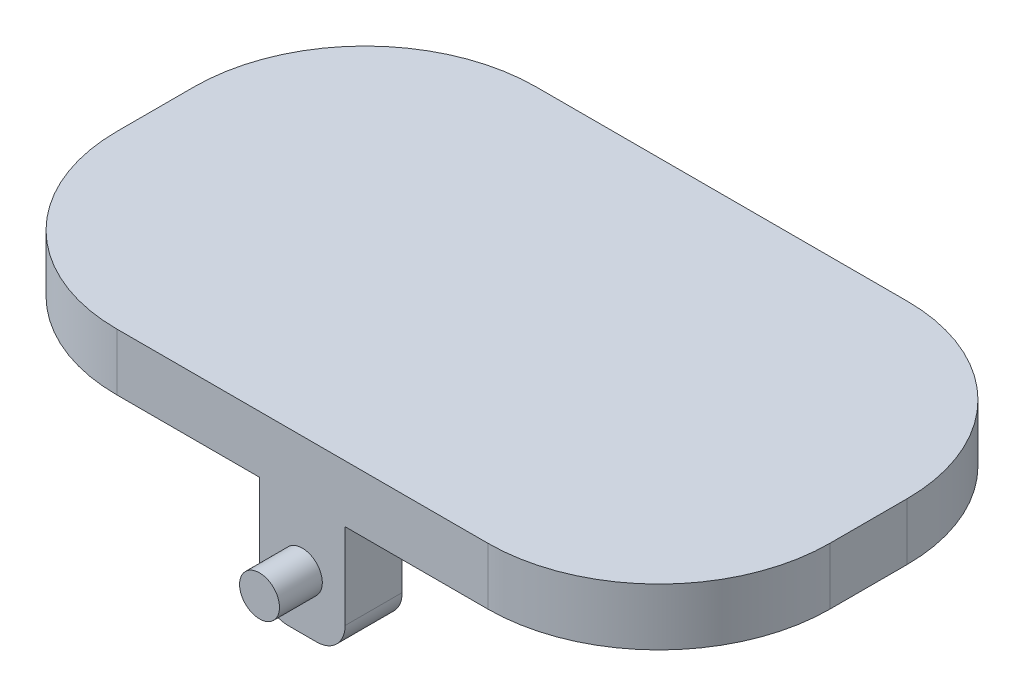
ISO-10303-21;
HEADER;
FILE_DESCRIPTION(('STEP AP214'),'2;1');
FILE_NAME('part.step','',(''),(''),'','','');
FILE_SCHEMA(('AUTOMOTIVE_DESIGN { 1 0 10303 214 1 1 1 1 }'));
ENDSEC;
DATA;
#1=APPLICATION_CONTEXT('core data for automotive mechanical design processes');
#2=APPLICATION_PROTOCOL_DEFINITION('international standard','automotive_design',2000,#1);
#3=PRODUCT_CONTEXT('',#1,'mechanical');
#4=PRODUCT('Part','Part','',(#3));
#5=PRODUCT_RELATED_PRODUCT_CATEGORY('part','',(#4));
#6=PRODUCT_DEFINITION_FORMATION('','',#4);
#7=PRODUCT_DEFINITION_CONTEXT('part definition',#1,'design');
#8=PRODUCT_DEFINITION('design','',#6,#7);
#9=PRODUCT_DEFINITION_SHAPE('','',#8);
#10=(LENGTH_UNIT() NAMED_UNIT(*) SI_UNIT(.MILLI.,.METRE.));
#11=(NAMED_UNIT(*) PLANE_ANGLE_UNIT() SI_UNIT($,.RADIAN.));
#12=(NAMED_UNIT(*) SI_UNIT($,.STERADIAN.) SOLID_ANGLE_UNIT());
#13=UNCERTAINTY_MEASURE_WITH_UNIT(LENGTH_MEASURE(1.E-05),#10,'distance_accuracy_value','');
#14=(GEOMETRIC_REPRESENTATION_CONTEXT(3) GLOBAL_UNCERTAINTY_ASSIGNED_CONTEXT((#13)) GLOBAL_UNIT_ASSIGNED_CONTEXT((#10,
#11,#12)) REPRESENTATION_CONTEXT('',''));
#15=CARTESIAN_POINT('',(0.,0.,0.));
#16=DIRECTION('',(0.,0.,1.));
#17=DIRECTION('',(1.,0.,0.));
#18=AXIS2_PLACEMENT_3D('',#15,#16,#17);
#19=CARTESIAN_POINT('',(0.,0.,0.));
#20=DIRECTION('',(0.,1.,0.));
#21=DIRECTION('',(0.,0.,1.));
#22=AXIS2_PLACEMENT_3D('',#19,#20,#21);
#23=PLANE('',#22);
#24=DIRECTION('',(0.,0.,1.));
#25=VECTOR('',#24,1.);
#26=CARTESIAN_POINT('',(1.5,0.,5.35));
#27=LINE('',#26,#25);
#28=CARTESIAN_POINT('',(1.5,0.,5.35));
#29=VERTEX_POINT('',#28);
#30=CARTESIAN_POINT('',(1.5,0.,7.35));
#31=VERTEX_POINT('',#30);
#32=EDGE_CURVE('E50',#29,#31,#27,.T.);
#33=ORIENTED_EDGE('',*,*,#32,.F.);
#34=DIRECTION('',(1.,0.,0.));
#35=VECTOR('',#34,1.);
#36=CARTESIAN_POINT('',(-1.5,0.,5.35));
#37=LINE('',#36,#35);
#38=CARTESIAN_POINT('',(-1.5,0.,5.35));
#39=VERTEX_POINT('',#38);
#40=EDGE_CURVE('E176',#39,#29,#37,.T.);
#41=ORIENTED_EDGE('',*,*,#40,.F.);
#42=DIRECTION('',(0.,0.,1.));
#43=VECTOR('',#42,1.);
#44=CARTESIAN_POINT('',(-1.5,0.,5.35));
#45=LINE('',#44,#43);
#46=CARTESIAN_POINT('',(-1.5,0.,7.35));
#47=VERTEX_POINT('',#46);
#48=EDGE_CURVE('E184',#39,#47,#45,.T.);
#49=ORIENTED_EDGE('',*,*,#48,.T.);
#50=DIRECTION('',(1.,0.,0.));
#51=VECTOR('',#50,1.);
#52=CARTESIAN_POINT('',(-12.5,0.,7.35));
#53=LINE('',#52,#51);
#54=CARTESIAN_POINT('',(-6.5,0.,7.35));
#55=VERTEX_POINT('',#54);
#56=EDGE_CURVE('E278',#55,#47,#53,.T.);
#57=ORIENTED_EDGE('',*,*,#56,.F.);
#58=CARTESIAN_POINT('',(-6.5,0.,1.35));
#59=DIRECTION('',(0.,1.,0.));
#60=DIRECTION('',(0.,0.,1.));
#61=AXIS2_PLACEMENT_3D('',#58,#59,#60);
#62=CIRCLE('',#61,6.);
#63=CARTESIAN_POINT('',(-12.5,0.,1.35));
#64=VERTEX_POINT('',#63);
#65=EDGE_CURVE('E311',#55,#64,#62,.F.);
#66=ORIENTED_EDGE('',*,*,#65,.T.);
#67=DIRECTION('',(0.,0.,1.));
#68=VECTOR('',#67,1.);
#69=CARTESIAN_POINT('',(-12.5,0.,-7.35));
#70=LINE('',#69,#68);
#71=CARTESIAN_POINT('',(-12.5,0.,-1.35));
#72=VERTEX_POINT('',#71);
#73=EDGE_CURVE('E294',#72,#64,#70,.T.);
#74=ORIENTED_EDGE('',*,*,#73,.F.);
#75=CARTESIAN_POINT('',(-6.5,0.,-1.35));
#76=DIRECTION('',(0.,1.,0.));
#77=DIRECTION('',(0.,0.,1.));
#78=AXIS2_PLACEMENT_3D('',#75,#76,#77);
#79=CIRCLE('',#78,6.);
#80=CARTESIAN_POINT('',(-6.5,0.,-7.35));
#81=VERTEX_POINT('',#80);
#82=EDGE_CURVE('E308',#72,#81,#79,.F.);
#83=ORIENTED_EDGE('',*,*,#82,.T.);
#84=DIRECTION('',(-1.,0.,0.));
#85=VECTOR('',#84,1.);
#86=CARTESIAN_POINT('',(-12.5,0.,-7.35));
#87=LINE('',#86,#85);
#88=CARTESIAN_POINT('',(-1.5,0.,-7.35));
#89=VERTEX_POINT('',#88);
#90=EDGE_CURVE('E290',#89,#81,#87,.T.);
#91=ORIENTED_EDGE('',*,*,#90,.F.);
#92=DIRECTION('',(0.,0.,-1.));
#93=VECTOR('',#92,1.);
#94=CARTESIAN_POINT('',(-1.5,0.,-5.35));
#95=LINE('',#94,#93);
#96=CARTESIAN_POINT('',(-1.5,0.,-5.35));
#97=VERTEX_POINT('',#96);
#98=EDGE_CURVE('E262',#97,#89,#95,.T.);
#99=ORIENTED_EDGE('',*,*,#98,.F.);
#100=DIRECTION('',(1.,0.,0.));
#101=VECTOR('',#100,1.);
#102=CARTESIAN_POINT('',(-1.5,0.,-5.35));
#103=LINE('',#102,#101);
#104=CARTESIAN_POINT('',(1.5,0.,-5.35));
#105=VERTEX_POINT('',#104);
#106=EDGE_CURVE('E230',#97,#105,#103,.T.);
#107=ORIENTED_EDGE('',*,*,#106,.T.);
#108=DIRECTION('',(0.,0.,-1.));
#109=VECTOR('',#108,1.);
#110=CARTESIAN_POINT('',(1.5,0.,-5.35));
#111=LINE('',#110,#109);
#112=CARTESIAN_POINT('',(1.5,0.,-7.35));
#113=VERTEX_POINT('',#112);
#114=EDGE_CURVE('E249',#105,#113,#111,.T.);
#115=ORIENTED_EDGE('',*,*,#114,.T.);
#116=CARTESIAN_POINT('',(6.5,0.,-7.35));
#117=VERTEX_POINT('',#116);
#118=EDGE_CURVE('E291',#117,#113,#87,.T.);
#119=ORIENTED_EDGE('',*,*,#118,.F.);
#120=CARTESIAN_POINT('',(6.5,0.,-1.35));
#121=DIRECTION('',(0.,1.,0.));
#122=DIRECTION('',(0.,0.,1.));
#123=AXIS2_PLACEMENT_3D('',#120,#121,#122);
#124=CIRCLE('',#123,6.);
#125=CARTESIAN_POINT('',(12.5,0.,-1.35));
#126=VERTEX_POINT('',#125);
#127=EDGE_CURVE('E306',#117,#126,#124,.F.);
#128=ORIENTED_EDGE('',*,*,#127,.T.);
#129=DIRECTION('',(0.,0.,-1.));
#130=VECTOR('',#129,1.);
#131=CARTESIAN_POINT('',(12.5,0.,-7.35));
#132=LINE('',#131,#130);
#133=CARTESIAN_POINT('',(12.5,0.,1.35));
#134=VERTEX_POINT('',#133);
#135=EDGE_CURVE('E264',#134,#126,#132,.T.);
#136=ORIENTED_EDGE('',*,*,#135,.F.);
#137=CARTESIAN_POINT('',(6.5,0.,1.35));
#138=DIRECTION('',(0.,1.,0.));
#139=DIRECTION('',(0.,0.,1.));
#140=AXIS2_PLACEMENT_3D('',#137,#138,#139);
#141=CIRCLE('',#140,6.);
#142=CARTESIAN_POINT('',(6.5,0.,7.35));
#143=VERTEX_POINT('',#142);
#144=EDGE_CURVE('E303',#134,#143,#141,.F.);
#145=ORIENTED_EDGE('',*,*,#144,.T.);
#146=EDGE_CURVE('E297',#31,#143,#53,.T.);
#147=ORIENTED_EDGE('',*,*,#146,.F.);
#148=EDGE_LOOP('',(#33,#41,#49,#57,#66,#74,#83,#91,#99,#107,#115,#119,#128,#136,#145,#147));
#149=FACE_BOUND('',#148,.T.);
#150=ADVANCED_FACE('F35',(#149),#23,.F.);
#151=CARTESIAN_POINT('',(12.5,2.,-7.35));
#152=DIRECTION('',(-1.,0.,0.));
#153=DIRECTION('',(0.,0.,1.));
#154=AXIS2_PLACEMENT_3D('',#151,#152,#153);
#155=PLANE('',#154);
#156=ORIENTED_EDGE('',*,*,#135,.T.);
#157=DIRECTION('',(0.,-1.,0.));
#158=VECTOR('',#157,1.);
#159=CARTESIAN_POINT('',(12.5,2.,-1.35));
#160=LINE('',#159,#158);
#161=CARTESIAN_POINT('',(12.5,2.,-1.35));
#162=VERTEX_POINT('',#161);
#163=EDGE_CURVE('E43',#126,#162,#160,.F.);
#164=ORIENTED_EDGE('',*,*,#163,.T.);
#165=DIRECTION('',(0.,0.,-1.));
#166=VECTOR('',#165,1.);
#167=CARTESIAN_POINT('',(12.5,2.,-7.35));
#168=LINE('',#167,#166);
#169=CARTESIAN_POINT('',(12.5,2.,1.35));
#170=VERTEX_POINT('',#169);
#171=EDGE_CURVE('E274',#170,#162,#168,.T.);
#172=ORIENTED_EDGE('',*,*,#171,.F.);
#173=DIRECTION('',(0.,-1.,0.));
#174=VECTOR('',#173,1.);
#175=CARTESIAN_POINT('',(12.5,2.,1.35));
#176=LINE('',#175,#174);
#177=EDGE_CURVE('E331',#170,#134,#176,.T.);
#178=ORIENTED_EDGE('',*,*,#177,.T.);
#179=EDGE_LOOP('',(#156,#164,#172,#178));
#180=FACE_BOUND('',#179,.T.);
#181=ADVANCED_FACE('F336',(#180),#155,.F.);
#182=CARTESIAN_POINT('',(-12.5,2.,-7.35));
#183=DIRECTION('',(0.,0.,1.));
#184=DIRECTION('',(1.,0.,0.));
#185=AXIS2_PLACEMENT_3D('',#182,#183,#184);
#186=PLANE('',#185);
#187=CARTESIAN_POINT('',(0.,-2.1,-7.35));
#188=DIRECTION('',(0.,0.,1.));
#189=DIRECTION('',(1.,0.,0.));
#190=AXIS2_PLACEMENT_3D('',#187,#188,#189);
#191=CIRCLE('',#190,0.7);
#192=CARTESIAN_POINT('',(0.7,-2.1,-7.35));
#193=VERTEX_POINT('',#192);
#194=EDGE_CURVE('E11',#193,#193,#191,.F.);
#195=ORIENTED_EDGE('',*,*,#194,.F.);
#196=EDGE_LOOP('',(#195));
#197=FACE_BOUND('',#196,.T.);
#198=ORIENTED_EDGE('',*,*,#118,.T.);
#199=DIRECTION('',(0.,-1.,0.));
#200=VECTOR('',#199,1.);
#201=CARTESIAN_POINT('',(1.5,0.,-7.35));
#202=LINE('',#201,#200);
#203=CARTESIAN_POINT('',(1.5,-3.,-7.35));
#204=VERTEX_POINT('',#203);
#205=EDGE_CURVE('E58',#113,#204,#202,.T.);
#206=ORIENTED_EDGE('',*,*,#205,.T.);
#207=CARTESIAN_POINT('',(0.5,-3.,-7.35));
#208=DIRECTION('',(0.,0.,-1.));
#209=DIRECTION('',(-1.,0.,0.));
#210=AXIS2_PLACEMENT_3D('',#207,#208,#209);
#211=CIRCLE('',#210,1.);
#212=CARTESIAN_POINT('',(0.5,-4.,-7.35));
#213=VERTEX_POINT('',#212);
#214=EDGE_CURVE('E251',#204,#213,#211,.T.);
#215=ORIENTED_EDGE('',*,*,#214,.T.);
#216=DIRECTION('',(-1.,0.,0.));
#217=VECTOR('',#216,1.);
#218=CARTESIAN_POINT('',(0.5,-4.,-7.35));
#219=LINE('',#218,#217);
#220=CARTESIAN_POINT('',(-0.500000000000001,-4.,-7.35));
#221=VERTEX_POINT('',#220);
#222=EDGE_CURVE('E254',#213,#221,#219,.T.);
#223=ORIENTED_EDGE('',*,*,#222,.T.);
#224=CARTESIAN_POINT('',(-0.500000000000001,-3.,-7.35));
#225=DIRECTION('',(0.,0.,-1.));
#226=DIRECTION('',(-1.,0.,0.));
#227=AXIS2_PLACEMENT_3D('',#224,#225,#226);
#228=CIRCLE('',#227,1.);
#229=CARTESIAN_POINT('',(-1.5,-3.,-7.35));
#230=VERTEX_POINT('',#229);
#231=EDGE_CURVE('E257',#221,#230,#228,.T.);
#232=ORIENTED_EDGE('',*,*,#231,.T.);
#233=DIRECTION('',(0.,1.,0.));
#234=VECTOR('',#233,1.);
#235=CARTESIAN_POINT('',(-1.5,-3.,-7.35));
#236=LINE('',#235,#234);
#237=EDGE_CURVE('E234',#230,#89,#236,.T.);
#238=ORIENTED_EDGE('',*,*,#237,.T.);
#239=ORIENTED_EDGE('',*,*,#90,.T.);
#240=DIRECTION('',(0.,-1.,0.));
#241=VECTOR('',#240,1.);
#242=CARTESIAN_POINT('',(-6.5,2.,-7.35));
#243=LINE('',#242,#241);
#244=CARTESIAN_POINT('',(-6.5,2.,-7.35));
#245=VERTEX_POINT('',#244);
#246=EDGE_CURVE('E329',#81,#245,#243,.F.);
#247=ORIENTED_EDGE('',*,*,#246,.T.);
#248=DIRECTION('',(-1.,0.,0.));
#249=VECTOR('',#248,1.);
#250=CARTESIAN_POINT('',(-12.5,2.,-7.35));
#251=LINE('',#250,#249);
#252=CARTESIAN_POINT('',(6.5,2.,-7.35));
#253=VERTEX_POINT('',#252);
#254=EDGE_CURVE('E277',#253,#245,#251,.T.);
#255=ORIENTED_EDGE('',*,*,#254,.F.);
#256=DIRECTION('',(0.,-1.,0.));
#257=VECTOR('',#256,1.);
#258=CARTESIAN_POINT('',(6.5,2.,-7.35));
#259=LINE('',#258,#257);
#260=EDGE_CURVE('E326',#253,#117,#259,.T.);
#261=ORIENTED_EDGE('',*,*,#260,.T.);
#262=EDGE_LOOP('',(#198,#206,#215,#223,#232,#238,#239,#247,#255,#261));
#263=FACE_BOUND('',#262,.T.);
#264=ADVANCED_FACE('F349',(#197,#263),#186,.F.);
#265=CARTESIAN_POINT('',(-12.5,2.,-7.35));
#266=DIRECTION('',(1.,0.,0.));
#267=DIRECTION('',(0.,0.,-1.));
#268=AXIS2_PLACEMENT_3D('',#265,#266,#267);
#269=PLANE('',#268);
#270=ORIENTED_EDGE('',*,*,#73,.T.);
#271=DIRECTION('',(0.,-1.,0.));
#272=VECTOR('',#271,1.);
#273=CARTESIAN_POINT('',(-12.5,2.,1.35));
#274=LINE('',#273,#272);
#275=CARTESIAN_POINT('',(-12.5,2.,1.35));
#276=VERTEX_POINT('',#275);
#277=EDGE_CURVE('E316',#64,#276,#274,.F.);
#278=ORIENTED_EDGE('',*,*,#277,.T.);
#279=DIRECTION('',(0.,0.,1.));
#280=VECTOR('',#279,1.);
#281=CARTESIAN_POINT('',(-12.5,2.,-7.35));
#282=LINE('',#281,#280);
#283=CARTESIAN_POINT('',(-12.5,2.,-1.35));
#284=VERTEX_POINT('',#283);
#285=EDGE_CURVE('E281',#284,#276,#282,.T.);
#286=ORIENTED_EDGE('',*,*,#285,.F.);
#287=DIRECTION('',(0.,-1.,0.));
#288=VECTOR('',#287,1.);
#289=CARTESIAN_POINT('',(-12.5,2.,-1.35));
#290=LINE('',#289,#288);
#291=EDGE_CURVE('E313',#284,#72,#290,.T.);
#292=ORIENTED_EDGE('',*,*,#291,.T.);
#293=EDGE_LOOP('',(#270,#278,#286,#292));
#294=FACE_BOUND('',#293,.T.);
#295=ADVANCED_FACE('F381',(#294),#269,.F.);
#296=CARTESIAN_POINT('',(-12.5,2.,7.35));
#297=DIRECTION('',(0.,0.,-1.));
#298=DIRECTION('',(-1.,0.,0.));
#299=AXIS2_PLACEMENT_3D('',#296,#297,#298);
#300=PLANE('',#299);
#301=CARTESIAN_POINT('',(0.,-2.1,7.35));
#302=DIRECTION('',(0.,0.,-1.));
#303=DIRECTION('',(-1.,0.,0.));
#304=AXIS2_PLACEMENT_3D('',#301,#302,#303);
#305=CIRCLE('',#304,0.7);
#306=CARTESIAN_POINT('',(-0.7,-2.1,7.35));
#307=VERTEX_POINT('',#306);
#308=EDGE_CURVE('E200',#307,#307,#305,.T.);
#309=ORIENTED_EDGE('',*,*,#308,.T.);
#310=EDGE_LOOP('',(#309));
#311=FACE_BOUND('',#310,.T.);
#312=DIRECTION('',(1.,0.,0.));
#313=VECTOR('',#312,1.);
#314=CARTESIAN_POINT('',(-12.5,2.,7.35));
#315=LINE('',#314,#313);
#316=CARTESIAN_POINT('',(-6.5,2.,7.35));
#317=VERTEX_POINT('',#316);
#318=CARTESIAN_POINT('',(6.5,2.,7.35));
#319=VERTEX_POINT('',#318);
#320=EDGE_CURVE('E284',#317,#319,#315,.T.);
#321=ORIENTED_EDGE('',*,*,#320,.F.);
#322=DIRECTION('',(0.,-1.,0.));
#323=VECTOR('',#322,1.);
#324=CARTESIAN_POINT('',(-6.5,2.,7.35));
#325=LINE('',#324,#323);
#326=EDGE_CURVE('E300',#317,#55,#325,.T.);
#327=ORIENTED_EDGE('',*,*,#326,.T.);
#328=ORIENTED_EDGE('',*,*,#56,.T.);
#329=DIRECTION('',(0.,1.,0.));
#330=VECTOR('',#329,1.);
#331=CARTESIAN_POINT('',(-1.5,-3.,7.35));
#332=LINE('',#331,#330);
#333=CARTESIAN_POINT('',(-1.5,-3.,7.35));
#334=VERTEX_POINT('',#333);
#335=EDGE_CURVE('E187',#334,#47,#332,.T.);
#336=ORIENTED_EDGE('',*,*,#335,.F.);
#337=CARTESIAN_POINT('',(-0.500000000000001,-3.,7.35));
#338=DIRECTION('',(0.,0.,-1.));
#339=DIRECTION('',(-1.,0.,0.));
#340=AXIS2_PLACEMENT_3D('',#337,#338,#339);
#341=CIRCLE('',#340,1.);
#342=CARTESIAN_POINT('',(-0.500000000000001,-4.,7.35));
#343=VERTEX_POINT('',#342);
#344=EDGE_CURVE('E210',#343,#334,#341,.T.);
#345=ORIENTED_EDGE('',*,*,#344,.F.);
#346=DIRECTION('',(-1.,0.,0.));
#347=VECTOR('',#346,1.);
#348=CARTESIAN_POINT('',(0.5,-4.,7.35));
#349=LINE('',#348,#347);
#350=CARTESIAN_POINT('',(0.5,-4.,7.35));
#351=VERTEX_POINT('',#350);
#352=EDGE_CURVE('E213',#351,#343,#349,.T.);
#353=ORIENTED_EDGE('',*,*,#352,.F.);
#354=CARTESIAN_POINT('',(0.5,-3.,7.35));
#355=DIRECTION('',(0.,0.,-1.));
#356=DIRECTION('',(-1.,0.,0.));
#357=AXIS2_PLACEMENT_3D('',#354,#355,#356);
#358=CIRCLE('',#357,1.);
#359=CARTESIAN_POINT('',(1.5,-3.,7.35));
#360=VERTEX_POINT('',#359);
#361=EDGE_CURVE('E197',#360,#351,#358,.T.);
#362=ORIENTED_EDGE('',*,*,#361,.F.);
#363=DIRECTION('',(0.,-1.,0.));
#364=VECTOR('',#363,1.);
#365=CARTESIAN_POINT('',(1.5,0.,7.35));
#366=LINE('',#365,#364);
#367=EDGE_CURVE('E195',#31,#360,#366,.T.);
#368=ORIENTED_EDGE('',*,*,#367,.F.);
#369=ORIENTED_EDGE('',*,*,#146,.T.);
#370=DIRECTION('',(0.,-1.,0.));
#371=VECTOR('',#370,1.);
#372=CARTESIAN_POINT('',(6.5,2.,7.35));
#373=LINE('',#372,#371);
#374=EDGE_CURVE('E287',#143,#319,#373,.F.);
#375=ORIENTED_EDGE('',*,*,#374,.T.);
#376=EDGE_LOOP('',(#321,#327,#328,#336,#345,#353,#362,#368,#369,#375));
#377=FACE_BOUND('',#376,.T.);
#378=ADVANCED_FACE('F388',(#311,#377),#300,.F.);
#379=CARTESIAN_POINT('',(0.,2.,0.));
#380=DIRECTION('',(0.,1.,0.));
#381=DIRECTION('',(0.,0.,1.));
#382=AXIS2_PLACEMENT_3D('',#379,#380,#381);
#383=PLANE('',#382);
#384=ORIENTED_EDGE('',*,*,#285,.T.);
#385=CARTESIAN_POINT('',(-6.5,2.,1.35));
#386=DIRECTION('',(0.,1.,0.));
#387=DIRECTION('',(0.,0.,1.));
#388=AXIS2_PLACEMENT_3D('',#385,#386,#387);
#389=CIRCLE('',#388,6.);
#390=EDGE_CURVE('E324',#276,#317,#389,.T.);
#391=ORIENTED_EDGE('',*,*,#390,.T.);
#392=ORIENTED_EDGE('',*,*,#320,.T.);
#393=CARTESIAN_POINT('',(6.5,2.,1.35));
#394=DIRECTION('',(0.,1.,0.));
#395=DIRECTION('',(0.,0.,1.));
#396=AXIS2_PLACEMENT_3D('',#393,#394,#395);
#397=CIRCLE('',#396,6.);
#398=EDGE_CURVE('E318',#319,#170,#397,.T.);
#399=ORIENTED_EDGE('',*,*,#398,.T.);
#400=ORIENTED_EDGE('',*,*,#171,.T.);
#401=CARTESIAN_POINT('',(6.5,2.,-1.35));
#402=DIRECTION('',(0.,1.,0.));
#403=DIRECTION('',(0.,0.,1.));
#404=AXIS2_PLACEMENT_3D('',#401,#402,#403);
#405=CIRCLE('',#404,6.);
#406=EDGE_CURVE('E320',#162,#253,#405,.T.);
#407=ORIENTED_EDGE('',*,*,#406,.T.);
#408=ORIENTED_EDGE('',*,*,#254,.T.);
#409=CARTESIAN_POINT('',(-6.5,2.,-1.35));
#410=DIRECTION('',(0.,1.,0.));
#411=DIRECTION('',(0.,0.,1.));
#412=AXIS2_PLACEMENT_3D('',#409,#410,#411);
#413=CIRCLE('',#412,6.);
#414=EDGE_CURVE('E322',#245,#284,#413,.T.);
#415=ORIENTED_EDGE('',*,*,#414,.T.);
#416=EDGE_LOOP('',(#384,#391,#392,#399,#400,#407,#408,#415));
#417=FACE_BOUND('',#416,.T.);
#418=ADVANCED_FACE('F342',(#417),#383,.T.);
#419=CARTESIAN_POINT('',(-6.5,2.,1.35));
#420=DIRECTION('',(0.,-1.,0.));
#421=DIRECTION('',(0.,0.,-1.));
#422=AXIS2_PLACEMENT_3D('',#419,#420,#421);
#423=CYLINDRICAL_SURFACE('',#422,6.);
#424=ORIENTED_EDGE('',*,*,#390,.F.);
#425=ORIENTED_EDGE('',*,*,#277,.F.);
#426=ORIENTED_EDGE('',*,*,#65,.F.);
#427=ORIENTED_EDGE('',*,*,#326,.F.);
#428=EDGE_LOOP('',(#424,#425,#426,#427));
#429=FACE_BOUND('',#428,.T.);
#430=ADVANCED_FACE('F384',(#429),#423,.T.);
#431=CARTESIAN_POINT('',(-6.5,2.,-1.35));
#432=DIRECTION('',(0.,-1.,0.));
#433=DIRECTION('',(0.,0.,-1.));
#434=AXIS2_PLACEMENT_3D('',#431,#432,#433);
#435=CYLINDRICAL_SURFACE('',#434,6.);
#436=ORIENTED_EDGE('',*,*,#414,.F.);
#437=ORIENTED_EDGE('',*,*,#246,.F.);
#438=ORIENTED_EDGE('',*,*,#82,.F.);
#439=ORIENTED_EDGE('',*,*,#291,.F.);
#440=EDGE_LOOP('',(#436,#437,#438,#439));
#441=FACE_BOUND('',#440,.T.);
#442=ADVANCED_FACE('F377',(#441),#435,.T.);
#443=CARTESIAN_POINT('',(6.5,2.,-1.35));
#444=DIRECTION('',(0.,-1.,0.));
#445=DIRECTION('',(0.,0.,-1.));
#446=AXIS2_PLACEMENT_3D('',#443,#444,#445);
#447=CYLINDRICAL_SURFACE('',#446,6.);
#448=ORIENTED_EDGE('',*,*,#406,.F.);
#449=ORIENTED_EDGE('',*,*,#163,.F.);
#450=ORIENTED_EDGE('',*,*,#127,.F.);
#451=ORIENTED_EDGE('',*,*,#260,.F.);
#452=EDGE_LOOP('',(#448,#449,#450,#451));
#453=FACE_BOUND('',#452,.T.);
#454=ADVANCED_FACE('F346',(#453),#447,.T.);
#455=CARTESIAN_POINT('',(6.5,2.,1.35));
#456=DIRECTION('',(0.,-1.,0.));
#457=DIRECTION('',(0.,0.,-1.));
#458=AXIS2_PLACEMENT_3D('',#455,#456,#457);
#459=CYLINDRICAL_SURFACE('',#458,6.);
#460=ORIENTED_EDGE('',*,*,#398,.F.);
#461=ORIENTED_EDGE('',*,*,#374,.F.);
#462=ORIENTED_EDGE('',*,*,#144,.F.);
#463=ORIENTED_EDGE('',*,*,#177,.F.);
#464=EDGE_LOOP('',(#460,#461,#462,#463));
#465=FACE_BOUND('',#464,.T.);
#466=ADVANCED_FACE('F37',(#465),#459,.T.);
#467=CARTESIAN_POINT('',(-1.5,-3.,-5.35));
#468=DIRECTION('',(-1.,0.,0.));
#469=DIRECTION('',(0.,-1.,0.));
#470=AXIS2_PLACEMENT_3D('',#467,#468,#469);
#471=PLANE('',#470);
#472=ORIENTED_EDGE('',*,*,#237,.F.);
#473=DIRECTION('',(0.,0.,-1.));
#474=VECTOR('',#473,1.);
#475=CARTESIAN_POINT('',(-1.5,-3.,-5.35));
#476=LINE('',#475,#474);
#477=CARTESIAN_POINT('',(-1.5,-3.,-5.35));
#478=VERTEX_POINT('',#477);
#479=EDGE_CURVE('E265',#478,#230,#476,.T.);
#480=ORIENTED_EDGE('',*,*,#479,.F.);
#481=DIRECTION('',(0.,1.,0.));
#482=VECTOR('',#481,1.);
#483=CARTESIAN_POINT('',(-1.5,-3.,-5.35));
#484=LINE('',#483,#482);
#485=EDGE_CURVE('E246',#478,#97,#484,.T.);
#486=ORIENTED_EDGE('',*,*,#485,.T.);
#487=ORIENTED_EDGE('',*,*,#98,.T.);
#488=EDGE_LOOP('',(#472,#480,#486,#487));
#489=FACE_BOUND('',#488,.T.);
#490=ADVANCED_FACE('F370',(#489),#471,.T.);
#491=CARTESIAN_POINT('',(-0.500000000000001,-3.,-5.35));
#492=DIRECTION('',(0.,0.,-1.));
#493=DIRECTION('',(-1.,0.,0.));
#494=AXIS2_PLACEMENT_3D('',#491,#492,#493);
#495=CYLINDRICAL_SURFACE('',#494,1.);
#496=ORIENTED_EDGE('',*,*,#231,.F.);
#497=DIRECTION('',(0.,0.,-1.));
#498=VECTOR('',#497,1.);
#499=CARTESIAN_POINT('',(-0.500000000000001,-4.,-5.35));
#500=LINE('',#499,#498);
#501=CARTESIAN_POINT('',(-0.500000000000001,-4.,-5.35));
#502=VERTEX_POINT('',#501);
#503=EDGE_CURVE('E267',#502,#221,#500,.T.);
#504=ORIENTED_EDGE('',*,*,#503,.F.);
#505=CARTESIAN_POINT('',(-0.500000000000001,-3.,-5.35));
#506=DIRECTION('',(0.,0.,-1.));
#507=DIRECTION('',(-1.,0.,0.));
#508=AXIS2_PLACEMENT_3D('',#505,#506,#507);
#509=CIRCLE('',#508,1.);
#510=EDGE_CURVE('E243',#502,#478,#509,.T.);
#511=ORIENTED_EDGE('',*,*,#510,.T.);
#512=ORIENTED_EDGE('',*,*,#479,.T.);
#513=EDGE_LOOP('',(#496,#504,#511,#512));
#514=FACE_BOUND('',#513,.T.);
#515=ADVANCED_FACE('F368',(#514),#495,.T.);
#516=CARTESIAN_POINT('',(0.5,-4.,-5.35));
#517=DIRECTION('',(0.,-1.,0.));
#518=DIRECTION('',(0.,0.,-1.));
#519=AXIS2_PLACEMENT_3D('',#516,#517,#518);
#520=PLANE('',#519);
#521=ORIENTED_EDGE('',*,*,#222,.F.);
#522=DIRECTION('',(0.,0.,-1.));
#523=VECTOR('',#522,1.);
#524=CARTESIAN_POINT('',(0.5,-4.,-5.35));
#525=LINE('',#524,#523);
#526=CARTESIAN_POINT('',(0.5,-4.,-5.35));
#527=VERTEX_POINT('',#526);
#528=EDGE_CURVE('E269',#527,#213,#525,.T.);
#529=ORIENTED_EDGE('',*,*,#528,.F.);
#530=DIRECTION('',(-1.,0.,0.));
#531=VECTOR('',#530,1.);
#532=CARTESIAN_POINT('',(0.5,-4.,-5.35));
#533=LINE('',#532,#531);
#534=EDGE_CURVE('E240',#527,#502,#533,.T.);
#535=ORIENTED_EDGE('',*,*,#534,.T.);
#536=ORIENTED_EDGE('',*,*,#503,.T.);
#537=EDGE_LOOP('',(#521,#529,#535,#536));
#538=FACE_BOUND('',#537,.T.);
#539=ADVANCED_FACE('F366',(#538),#520,.T.);
#540=CARTESIAN_POINT('',(0.5,-3.,-5.35));
#541=DIRECTION('',(0.,0.,-1.));
#542=DIRECTION('',(-1.,0.,0.));
#543=AXIS2_PLACEMENT_3D('',#540,#541,#542);
#544=CYLINDRICAL_SURFACE('',#543,1.);
#545=ORIENTED_EDGE('',*,*,#214,.F.);
#546=DIRECTION('',(0.,0.,-1.));
#547=VECTOR('',#546,1.);
#548=CARTESIAN_POINT('',(1.5,-3.,-5.35));
#549=LINE('',#548,#547);
#550=CARTESIAN_POINT('',(1.5,-3.,-5.35));
#551=VERTEX_POINT('',#550);
#552=EDGE_CURVE('E271',#551,#204,#549,.T.);
#553=ORIENTED_EDGE('',*,*,#552,.F.);
#554=CARTESIAN_POINT('',(0.5,-3.,-5.35));
#555=DIRECTION('',(0.,0.,-1.));
#556=DIRECTION('',(-1.,0.,0.));
#557=AXIS2_PLACEMENT_3D('',#554,#555,#556);
#558=CIRCLE('',#557,1.);
#559=EDGE_CURVE('E237',#551,#527,#558,.T.);
#560=ORIENTED_EDGE('',*,*,#559,.T.);
#561=ORIENTED_EDGE('',*,*,#528,.T.);
#562=EDGE_LOOP('',(#545,#553,#560,#561));
#563=FACE_BOUND('',#562,.T.);
#564=ADVANCED_FACE('F361',(#563),#544,.T.);
#565=CARTESIAN_POINT('',(1.5,0.,-5.35));
#566=DIRECTION('',(1.,0.,0.));
#567=DIRECTION('',(0.,1.,0.));
#568=AXIS2_PLACEMENT_3D('',#565,#566,#567);
#569=PLANE('',#568);
#570=ORIENTED_EDGE('',*,*,#205,.F.);
#571=ORIENTED_EDGE('',*,*,#114,.F.);
#572=DIRECTION('',(0.,-1.,0.));
#573=VECTOR('',#572,1.);
#574=CARTESIAN_POINT('',(1.5,0.,-5.35));
#575=LINE('',#574,#573);
#576=EDGE_CURVE('E233',#105,#551,#575,.T.);
#577=ORIENTED_EDGE('',*,*,#576,.T.);
#578=ORIENTED_EDGE('',*,*,#552,.T.);
#579=EDGE_LOOP('',(#570,#571,#577,#578));
#580=FACE_BOUND('',#579,.T.);
#581=ADVANCED_FACE('F352',(#580),#569,.T.);
#582=CARTESIAN_POINT('',(0.5,-3.,-5.35));
#583=DIRECTION('',(0.,0.,-1.));
#584=DIRECTION('',(-1.,0.,0.));
#585=AXIS2_PLACEMENT_3D('',#582,#583,#584);
#586=PLANE('',#585);
#587=ORIENTED_EDGE('',*,*,#106,.F.);
#588=ORIENTED_EDGE('',*,*,#485,.F.);
#589=ORIENTED_EDGE('',*,*,#510,.F.);
#590=ORIENTED_EDGE('',*,*,#534,.F.);
#591=ORIENTED_EDGE('',*,*,#559,.F.);
#592=ORIENTED_EDGE('',*,*,#576,.F.);
#593=EDGE_LOOP('',(#587,#588,#589,#590,#591,#592));
#594=FACE_BOUND('',#593,.T.);
#595=ADVANCED_FACE('F355',(#594),#586,.F.);
#596=CARTESIAN_POINT('',(0.,-2.1,-8.85));
#597=DIRECTION('',(0.,0.,1.));
#598=DIRECTION('',(1.,0.,0.));
#599=AXIS2_PLACEMENT_3D('',#596,#597,#598);
#600=CYLINDRICAL_SURFACE('',#599,0.7);
#601=CARTESIAN_POINT('',(0.,-2.1,-8.85));
#602=DIRECTION('',(0.,0.,-1.));
#603=DIRECTION('',(-1.,0.,0.));
#604=AXIS2_PLACEMENT_3D('',#601,#602,#603);
#605=CIRCLE('',#604,0.7);
#606=CARTESIAN_POINT('',(-0.7,-2.1,-8.85));
#607=VERTEX_POINT('',#606);
#608=EDGE_CURVE('E217',#607,#607,#605,.T.);
#609=ORIENTED_EDGE('',*,*,#608,.F.);
#610=EDGE_LOOP('',(#609));
#611=FACE_BOUND('',#610,.T.);
#612=ORIENTED_EDGE('',*,*,#194,.T.);
#613=EDGE_LOOP('',(#612));
#614=FACE_BOUND('',#613,.T.);
#615=ADVANCED_FACE('F477',(#611,#614),#600,.T.);
#616=CARTESIAN_POINT('',(0.,-2.1,-8.85));
#617=DIRECTION('',(0.,0.,-1.));
#618=DIRECTION('',(-1.,0.,0.));
#619=AXIS2_PLACEMENT_3D('',#616,#617,#618);
#620=PLANE('',#619);
#621=ORIENTED_EDGE('',*,*,#608,.T.);
#622=EDGE_LOOP('',(#621));
#623=FACE_BOUND('',#622,.T.);
#624=ADVANCED_FACE('F492',(#623),#620,.T.);
#625=CARTESIAN_POINT('',(1.5,0.,5.35));
#626=DIRECTION('',(-1.,0.,0.));
#627=DIRECTION('',(0.,-1.,0.));
#628=AXIS2_PLACEMENT_3D('',#625,#626,#627);
#629=PLANE('',#628);
#630=ORIENTED_EDGE('',*,*,#367,.T.);
#631=DIRECTION('',(0.,0.,1.));
#632=VECTOR('',#631,1.);
#633=CARTESIAN_POINT('',(1.5,-3.,5.35));
#634=LINE('',#633,#632);
#635=CARTESIAN_POINT('',(1.5,-3.,5.35));
#636=VERTEX_POINT('',#635);
#637=EDGE_CURVE('E218',#636,#360,#634,.T.);
#638=ORIENTED_EDGE('',*,*,#637,.F.);
#639=DIRECTION('',(0.,-1.,0.));
#640=VECTOR('',#639,1.);
#641=CARTESIAN_POINT('',(1.5,0.,5.35));
#642=LINE('',#641,#640);
#643=EDGE_CURVE('E192',#29,#636,#642,.T.);
#644=ORIENTED_EDGE('',*,*,#643,.F.);
#645=ORIENTED_EDGE('',*,*,#32,.T.);
#646=EDGE_LOOP('',(#630,#638,#644,#645));
#647=FACE_BOUND('',#646,.T.);
#648=ADVANCED_FACE('F501',(#647),#629,.F.);
#649=CARTESIAN_POINT('',(0.5,-3.,5.35));
#650=DIRECTION('',(0.,0.,1.));
#651=DIRECTION('',(1.,0.,0.));
#652=AXIS2_PLACEMENT_3D('',#649,#650,#651);
#653=CYLINDRICAL_SURFACE('',#652,1.);
#654=ORIENTED_EDGE('',*,*,#361,.T.);
#655=DIRECTION('',(0.,0.,1.));
#656=VECTOR('',#655,1.);
#657=CARTESIAN_POINT('',(0.5,-4.,5.35));
#658=LINE('',#657,#656);
#659=CARTESIAN_POINT('',(0.5,-4.,5.35));
#660=VERTEX_POINT('',#659);
#661=EDGE_CURVE('E221',#660,#351,#658,.T.);
#662=ORIENTED_EDGE('',*,*,#661,.F.);
#663=CARTESIAN_POINT('',(0.5,-3.,5.35));
#664=DIRECTION('',(0.,0.,-1.));
#665=DIRECTION('',(-1.,0.,0.));
#666=AXIS2_PLACEMENT_3D('',#663,#664,#665);
#667=CIRCLE('',#666,1.);
#668=EDGE_CURVE('E206',#636,#660,#667,.T.);
#669=ORIENTED_EDGE('',*,*,#668,.F.);
#670=ORIENTED_EDGE('',*,*,#637,.T.);
#671=EDGE_LOOP('',(#654,#662,#669,#670));
#672=FACE_BOUND('',#671,.T.);
#673=ADVANCED_FACE('F523',(#672),#653,.T.);
#674=CARTESIAN_POINT('',(0.5,-4.,5.35));
#675=DIRECTION('',(0.,1.,0.));
#676=DIRECTION('',(0.,0.,1.));
#677=AXIS2_PLACEMENT_3D('',#674,#675,#676);
#678=PLANE('',#677);
#679=ORIENTED_EDGE('',*,*,#352,.T.);
#680=DIRECTION('',(0.,0.,1.));
#681=VECTOR('',#680,1.);
#682=CARTESIAN_POINT('',(-0.500000000000001,-4.,5.35));
#683=LINE('',#682,#681);
#684=CARTESIAN_POINT('',(-0.500000000000001,-4.,5.35));
#685=VERTEX_POINT('',#684);
#686=EDGE_CURVE('E224',#685,#343,#683,.T.);
#687=ORIENTED_EDGE('',*,*,#686,.F.);
#688=DIRECTION('',(-1.,0.,0.));
#689=VECTOR('',#688,1.);
#690=CARTESIAN_POINT('',(0.5,-4.,5.35));
#691=LINE('',#690,#689);
#692=EDGE_CURVE('E204',#660,#685,#691,.T.);
#693=ORIENTED_EDGE('',*,*,#692,.F.);
#694=ORIENTED_EDGE('',*,*,#661,.T.);
#695=EDGE_LOOP('',(#679,#687,#693,#694));
#696=FACE_BOUND('',#695,.T.);
#697=ADVANCED_FACE('F532',(#696),#678,.F.);
#698=CARTESIAN_POINT('',(-0.500000000000001,-3.,5.35));
#699=DIRECTION('',(0.,0.,1.));
#700=DIRECTION('',(1.,0.,0.));
#701=AXIS2_PLACEMENT_3D('',#698,#699,#700);
#702=CYLINDRICAL_SURFACE('',#701,1.);
#703=ORIENTED_EDGE('',*,*,#344,.T.);
#704=DIRECTION('',(0.,0.,1.));
#705=VECTOR('',#704,1.);
#706=CARTESIAN_POINT('',(-1.5,-3.,5.35));
#707=LINE('',#706,#705);
#708=CARTESIAN_POINT('',(-1.5,-3.,5.35));
#709=VERTEX_POINT('',#708);
#710=EDGE_CURVE('E191',#709,#334,#707,.T.);
#711=ORIENTED_EDGE('',*,*,#710,.F.);
#712=CARTESIAN_POINT('',(-0.500000000000001,-3.,5.35));
#713=DIRECTION('',(0.,0.,-1.));
#714=DIRECTION('',(-1.,0.,0.));
#715=AXIS2_PLACEMENT_3D('',#712,#713,#714);
#716=CIRCLE('',#715,1.);
#717=EDGE_CURVE('E178',#685,#709,#716,.T.);
#718=ORIENTED_EDGE('',*,*,#717,.F.);
#719=ORIENTED_EDGE('',*,*,#686,.T.);
#720=EDGE_LOOP('',(#703,#711,#718,#719));
#721=FACE_BOUND('',#720,.T.);
#722=ADVANCED_FACE('F542',(#721),#702,.T.);
#723=CARTESIAN_POINT('',(-1.5,-3.,5.35));
#724=DIRECTION('',(1.,0.,0.));
#725=DIRECTION('',(0.,1.,0.));
#726=AXIS2_PLACEMENT_3D('',#723,#724,#725);
#727=PLANE('',#726);
#728=ORIENTED_EDGE('',*,*,#335,.T.);
#729=ORIENTED_EDGE('',*,*,#48,.F.);
#730=DIRECTION('',(0.,1.,0.));
#731=VECTOR('',#730,1.);
#732=CARTESIAN_POINT('',(-1.5,-3.,5.35));
#733=LINE('',#732,#731);
#734=EDGE_CURVE('E172',#709,#39,#733,.T.);
#735=ORIENTED_EDGE('',*,*,#734,.F.);
#736=ORIENTED_EDGE('',*,*,#710,.T.);
#737=EDGE_LOOP('',(#728,#729,#735,#736));
#738=FACE_BOUND('',#737,.T.);
#739=ADVANCED_FACE('F185',(#738),#727,.F.);
#740=CARTESIAN_POINT('',(0.5,-3.,5.35));
#741=DIRECTION('',(0.,0.,1.));
#742=DIRECTION('',(-1.,0.,0.));
#743=AXIS2_PLACEMENT_3D('',#740,#741,#742);
#744=PLANE('',#743);
#745=ORIENTED_EDGE('',*,*,#40,.T.);
#746=ORIENTED_EDGE('',*,*,#643,.T.);
#747=ORIENTED_EDGE('',*,*,#668,.T.);
#748=ORIENTED_EDGE('',*,*,#692,.T.);
#749=ORIENTED_EDGE('',*,*,#717,.T.);
#750=ORIENTED_EDGE('',*,*,#734,.T.);
#751=EDGE_LOOP('',(#745,#746,#747,#748,#749,#750));
#752=FACE_BOUND('',#751,.T.);
#753=ADVANCED_FACE('F174',(#752),#744,.F.);
#754=CARTESIAN_POINT('',(0.,-2.1,8.85));
#755=DIRECTION('',(0.,0.,-1.));
#756=DIRECTION('',(-1.,0.,0.));
#757=AXIS2_PLACEMENT_3D('',#754,#755,#756);
#758=CYLINDRICAL_SURFACE('',#757,0.7);
#759=CARTESIAN_POINT('',(0.,-2.1,8.85));
#760=DIRECTION('',(0.,0.,-1.));
#761=DIRECTION('',(-1.,0.,0.));
#762=AXIS2_PLACEMENT_3D('',#759,#760,#761);
#763=CIRCLE('',#762,0.7);
#764=CARTESIAN_POINT('',(-0.7,-2.1,8.85));
#765=VERTEX_POINT('',#764);
#766=EDGE_CURVE('E211',#765,#765,#763,.T.);
#767=ORIENTED_EDGE('',*,*,#766,.T.);
#768=EDGE_LOOP('',(#767));
#769=FACE_BOUND('',#768,.T.);
#770=ORIENTED_EDGE('',*,*,#308,.F.);
#771=EDGE_LOOP('',(#770));
#772=FACE_BOUND('',#771,.T.);
#773=ADVANCED_FACE('F569',(#769,#772),#758,.T.);
#774=CARTESIAN_POINT('',(0.,-2.1,8.85));
#775=DIRECTION('',(0.,0.,1.));
#776=DIRECTION('',(-1.,0.,0.));
#777=AXIS2_PLACEMENT_3D('',#774,#775,#776);
#778=PLANE('',#777);
#779=ORIENTED_EDGE('',*,*,#766,.F.);
#780=EDGE_LOOP('',(#779));
#781=FACE_BOUND('',#780,.T.);
#782=ADVANCED_FACE('F578',(#781),#778,.T.);
#783=CLOSED_SHELL('',(#150,#181,#264,#295,#378,#418,#430,#442,#454,#466,#490,#515,#539,#564,
#581,#595,#615,#624,#648,#673,#697,#722,#739,#753,#773,#782));
#784=MANIFOLD_SOLID_BREP('B2',#783);
#785=ADVANCED_BREP_SHAPE_REPRESENTATION('',(#18,#784),#14);
#786=SHAPE_DEFINITION_REPRESENTATION(#9,#785);
ENDSEC;
END-ISO-10303-21;
